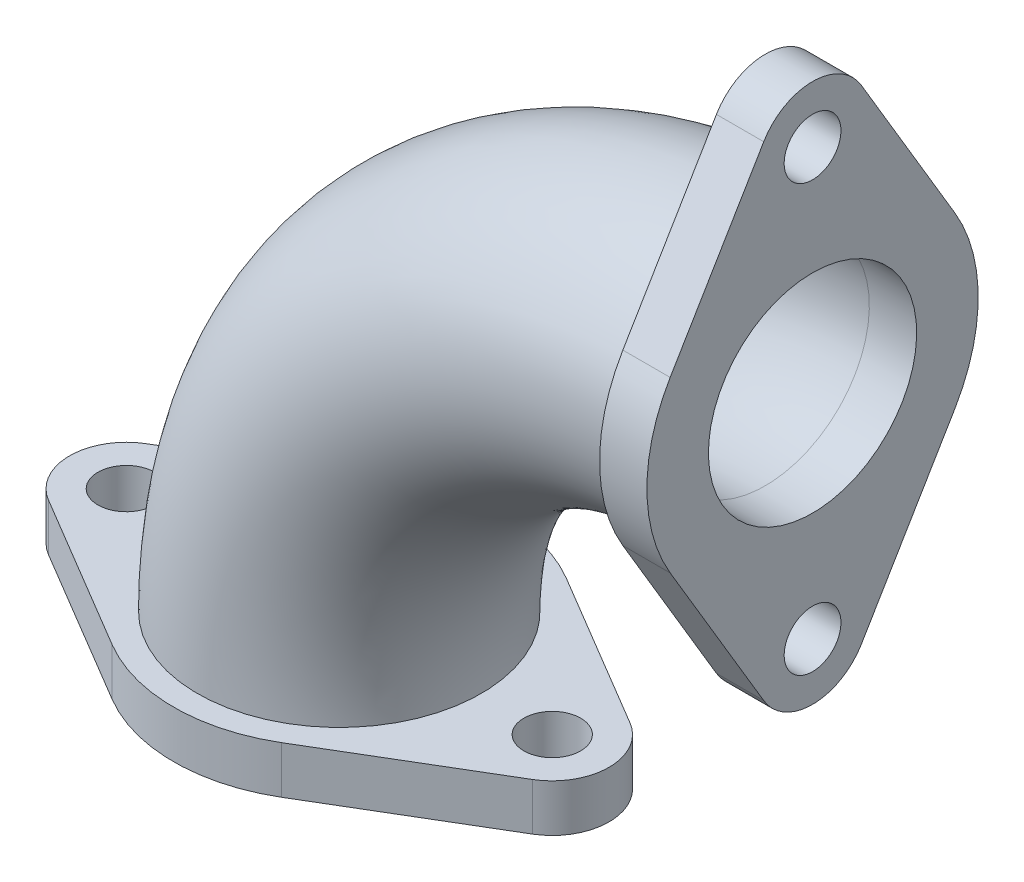
ISO-10303-21;
HEADER;
FILE_DESCRIPTION(('STEP AP214'),'2;1');
FILE_NAME('part.step','',(''),(''),'','','');
FILE_SCHEMA(('AUTOMOTIVE_DESIGN { 1 0 10303 214 1 1 1 1 }'));
ENDSEC;
DATA;
#1=APPLICATION_CONTEXT('core data for automotive mechanical design processes');
#2=APPLICATION_PROTOCOL_DEFINITION('international standard','automotive_design',2000,#1);
#3=PRODUCT_CONTEXT('',#1,'mechanical');
#4=PRODUCT('Part','Part','',(#3));
#5=PRODUCT_RELATED_PRODUCT_CATEGORY('part','',(#4));
#6=PRODUCT_DEFINITION_FORMATION('','',#4);
#7=PRODUCT_DEFINITION_CONTEXT('part definition',#1,'design');
#8=PRODUCT_DEFINITION('design','',#6,#7);
#9=PRODUCT_DEFINITION_SHAPE('','',#8);
#10=(LENGTH_UNIT() NAMED_UNIT(*) SI_UNIT(.MILLI.,.METRE.));
#11=(NAMED_UNIT(*) PLANE_ANGLE_UNIT() SI_UNIT($,.RADIAN.));
#12=(NAMED_UNIT(*) SI_UNIT($,.STERADIAN.) SOLID_ANGLE_UNIT());
#13=UNCERTAINTY_MEASURE_WITH_UNIT(LENGTH_MEASURE(1.E-05),#10,'distance_accuracy_value','');
#14=(GEOMETRIC_REPRESENTATION_CONTEXT(3) GLOBAL_UNCERTAINTY_ASSIGNED_CONTEXT((#13)) GLOBAL_UNIT_ASSIGNED_CONTEXT((#10,
#11,#12)) REPRESENTATION_CONTEXT('',''));
#15=CARTESIAN_POINT('',(0.,0.,0.));
#16=DIRECTION('',(0.,0.,1.));
#17=DIRECTION('',(1.,0.,0.));
#18=AXIS2_PLACEMENT_3D('',#15,#16,#17);
#19=CARTESIAN_POINT('',(0.,0.,0.));
#20=DIRECTION('',(0.,0.,-1.));
#21=DIRECTION('',(-1.,0.,0.));
#22=AXIS2_PLACEMENT_3D('',#19,#20,#21);
#23=TOROIDAL_SURFACE('',#22,45.,15.);
#24=CARTESIAN_POINT('',(-45.,0.,0.));
#25=DIRECTION('',(0.,1.,0.));
#26=DIRECTION('',(-1.,0.,0.));
#27=AXIS2_PLACEMENT_3D('',#24,#25,#26);
#28=CIRCLE('',#27,15.);
#29=CARTESIAN_POINT('',(-60.,0.,0.));
#30=VERTEX_POINT('',#29);
#31=EDGE_CURVE('E175',#30,#30,#28,.T.);
#32=CARTESIAN_POINT('',(0.,45.,0.));
#33=DIRECTION('',(1.,0.,0.));
#34=DIRECTION('',(0.,1.,0.));
#35=AXIS2_PLACEMENT_3D('',#32,#33,#34);
#36=CIRCLE('',#35,15.);
#37=CARTESIAN_POINT('',(0.,60.,0.));
#38=VERTEX_POINT('',#37);
#39=EDGE_CURVE('E12',#38,#38,#36,.T.);
#40=CARTESIAN_POINT('',(0.,0.,0.));
#41=DIRECTION('',(0.,0.,-1.));
#42=DIRECTION('',(-1.,0.,0.));
#43=AXIS2_PLACEMENT_3D('',#40,#41,#42);
#44=CIRCLE('',#43,60.);
#45=EDGE_CURVE('',#30,#38,#44,.T.);
#46=ORIENTED_EDGE('',*,*,#31,.T.);
#47=ORIENTED_EDGE('',*,*,#39,.F.);
#48=ORIENTED_EDGE('',*,*,#45,.T.);
#49=ORIENTED_EDGE('',*,*,#45,.F.);
#50=EDGE_LOOP('',(#46,#48,#47,#49));
#51=FACE_BOUND('',#50,.T.);
#52=ADVANCED_FACE('F42',(#51),#23,.T.);
#53=CARTESIAN_POINT('',(0.,0.,0.));
#54=DIRECTION('',(0.,0.,-1.));
#55=DIRECTION('',(-1.,0.,0.));
#56=AXIS2_PLACEMENT_3D('',#53,#54,#55);
#57=TOROIDAL_SURFACE('',#56,45.,11.);
#58=CARTESIAN_POINT('',(-45.,0.,0.));
#59=DIRECTION('',(0.,1.,0.));
#60=DIRECTION('',(-1.,0.,0.));
#61=AXIS2_PLACEMENT_3D('',#58,#59,#60);
#62=CIRCLE('',#61,11.);
#63=CARTESIAN_POINT('',(-56.,0.,0.));
#64=VERTEX_POINT('',#63);
#65=EDGE_CURVE('E50',#64,#64,#62,.T.);
#66=CARTESIAN_POINT('',(0.,45.,0.));
#67=DIRECTION('',(1.,0.,0.));
#68=DIRECTION('',(0.,1.,0.));
#69=AXIS2_PLACEMENT_3D('',#66,#67,#68);
#70=CIRCLE('',#69,11.);
#71=CARTESIAN_POINT('',(0.,56.,0.));
#72=VERTEX_POINT('',#71);
#73=EDGE_CURVE('E204',#72,#72,#70,.T.);
#74=CARTESIAN_POINT('',(0.,0.,0.));
#75=DIRECTION('',(0.,0.,-1.));
#76=DIRECTION('',(-1.,0.,0.));
#77=AXIS2_PLACEMENT_3D('',#74,#75,#76);
#78=CIRCLE('',#77,56.);
#79=EDGE_CURVE('',#64,#72,#78,.T.);
#80=ORIENTED_EDGE('',*,*,#65,.F.);
#81=ORIENTED_EDGE('',*,*,#73,.T.);
#82=ORIENTED_EDGE('',*,*,#79,.T.);
#83=ORIENTED_EDGE('',*,*,#79,.F.);
#84=EDGE_LOOP('',(#80,#82,#81,#83));
#85=FACE_BOUND('',#84,.T.);
#86=ADVANCED_FACE('F249',(#85),#57,.F.);
#87=CARTESIAN_POINT('',(5.,45.,0.));
#88=DIRECTION('',(1.,0.,0.));
#89=DIRECTION('',(0.,1.,0.));
#90=AXIS2_PLACEMENT_3D('',#87,#88,#89);
#91=PLANE('',#90);
#92=CARTESIAN_POINT('',(5.,67.5,0.));
#93=DIRECTION('',(1.,0.,0.));
#94=DIRECTION('',(0.,1.,0.));
#95=AXIS2_PLACEMENT_3D('',#92,#93,#94);
#96=CIRCLE('',#95,3.);
#97=CARTESIAN_POINT('',(5.,70.5,0.));
#98=VERTEX_POINT('',#97);
#99=EDGE_CURVE('E201',#98,#98,#96,.T.);
#100=ORIENTED_EDGE('',*,*,#99,.F.);
#101=EDGE_LOOP('',(#100));
#102=FACE_BOUND('',#101,.T.);
#103=CARTESIAN_POINT('',(5.,45.,0.));
#104=DIRECTION('',(1.,0.,0.));
#105=DIRECTION('',(0.,1.,0.));
#106=AXIS2_PLACEMENT_3D('',#103,#104,#105);
#107=CIRCLE('',#106,17.5);
#108=CARTESIAN_POINT('',(5.,53.9444444444444,15.0415063600773));
#109=VERTEX_POINT('',#108);
#110=CARTESIAN_POINT('',(5.,36.0555555555556,15.0415063600773));
#111=VERTEX_POINT('',#110);
#112=EDGE_CURVE('E159',#109,#111,#107,.T.);
#113=ORIENTED_EDGE('',*,*,#112,.T.);
#114=DIRECTION('',(0.,-0.859514649147276,-0.511111111111112));
#115=VECTOR('',#114,1.);
#116=CARTESIAN_POINT('',(5.,36.0555555555556,15.0415063600773));
#117=LINE('',#116,#115);
#118=CARTESIAN_POINT('',(5.,19.4333333333333,5.15708789488364));
#119=VERTEX_POINT('',#118);
#120=EDGE_CURVE('E103',#111,#119,#117,.T.);
#121=ORIENTED_EDGE('',*,*,#120,.T.);
#122=CARTESIAN_POINT('',(5.,22.5,0.));
#123=DIRECTION('',(1.,0.,0.));
#124=DIRECTION('',(0.,1.,0.));
#125=AXIS2_PLACEMENT_3D('',#122,#123,#124);
#126=CIRCLE('',#125,5.99999999999999);
#127=CARTESIAN_POINT('',(5.,19.4333333333333,-5.15708789488365));
#128=VERTEX_POINT('',#127);
#129=EDGE_CURVE('E213',#119,#128,#126,.T.);
#130=ORIENTED_EDGE('',*,*,#129,.T.);
#131=DIRECTION('',(0.,0.859514649147276,-0.511111111111112));
#132=VECTOR('',#131,1.);
#133=CARTESIAN_POINT('',(5.,36.0555555555556,-15.0415063600773));
#134=LINE('',#133,#132);
#135=CARTESIAN_POINT('',(5.,36.0555555555556,-15.0415063600773));
#136=VERTEX_POINT('',#135);
#137=EDGE_CURVE('E215',#128,#136,#134,.T.);
#138=ORIENTED_EDGE('',*,*,#137,.T.);
#139=CARTESIAN_POINT('',(5.,45.,0.));
#140=DIRECTION('',(1.,0.,0.));
#141=DIRECTION('',(0.,1.,0.));
#142=AXIS2_PLACEMENT_3D('',#139,#140,#141);
#143=CIRCLE('',#142,17.5);
#144=CARTESIAN_POINT('',(5.,53.9444444444444,-15.0415063600773));
#145=VERTEX_POINT('',#144);
#146=EDGE_CURVE('E126',#136,#145,#143,.T.);
#147=ORIENTED_EDGE('',*,*,#146,.T.);
#148=DIRECTION('',(0.,0.859514649147276,0.511111111111111));
#149=VECTOR('',#148,1.);
#150=CARTESIAN_POINT('',(5.,70.5666666666667,-5.15708789488367));
#151=LINE('',#150,#149);
#152=CARTESIAN_POINT('',(5.,70.5666666666667,-5.15708789488367));
#153=VERTEX_POINT('',#152);
#154=EDGE_CURVE('E119',#145,#153,#151,.T.);
#155=ORIENTED_EDGE('',*,*,#154,.T.);
#156=CARTESIAN_POINT('',(5.,67.5,0.));
#157=DIRECTION('',(1.,0.,0.));
#158=DIRECTION('',(0.,1.,0.));
#159=AXIS2_PLACEMENT_3D('',#156,#157,#158);
#160=CIRCLE('',#159,6.);
#161=CARTESIAN_POINT('',(5.,70.5666666666667,5.15708789488366));
#162=VERTEX_POINT('',#161);
#163=EDGE_CURVE('E124',#153,#162,#160,.T.);
#164=ORIENTED_EDGE('',*,*,#163,.T.);
#165=DIRECTION('',(0.,-0.859514649147276,0.511111111111112));
#166=VECTOR('',#165,1.);
#167=CARTESIAN_POINT('',(5.,70.5666666666667,5.15708789488364));
#168=LINE('',#167,#166);
#169=EDGE_CURVE('E58',#162,#109,#168,.T.);
#170=ORIENTED_EDGE('',*,*,#169,.T.);
#171=EDGE_LOOP('',(#113,#121,#130,#138,#147,#155,#164,#170));
#172=FACE_BOUND('',#171,.T.);
#173=CARTESIAN_POINT('',(5.,45.,0.));
#174=DIRECTION('',(1.,0.,0.));
#175=DIRECTION('',(0.,1.,0.));
#176=AXIS2_PLACEMENT_3D('',#173,#174,#175);
#177=CIRCLE('',#176,11.);
#178=CARTESIAN_POINT('',(5.,56.,0.));
#179=VERTEX_POINT('',#178);
#180=EDGE_CURVE('E148',#179,#179,#177,.T.);
#181=ORIENTED_EDGE('',*,*,#180,.F.);
#182=EDGE_LOOP('',(#181));
#183=FACE_BOUND('',#182,.T.);
#184=CARTESIAN_POINT('',(5.,22.5,0.));
#185=DIRECTION('',(1.,0.,0.));
#186=DIRECTION('',(0.,1.,0.));
#187=AXIS2_PLACEMENT_3D('',#184,#185,#186);
#188=CIRCLE('',#187,3.);
#189=CARTESIAN_POINT('',(5.,25.5,0.));
#190=VERTEX_POINT('',#189);
#191=EDGE_CURVE('E182',#190,#190,#188,.T.);
#192=ORIENTED_EDGE('',*,*,#191,.F.);
#193=EDGE_LOOP('',(#192));
#194=FACE_BOUND('',#193,.T.);
#195=ADVANCED_FACE('F121',(#102,#172,#183,#194),#91,.T.);
#196=CARTESIAN_POINT('',(0.,45.,0.));
#197=DIRECTION('',(1.,0.,0.));
#198=DIRECTION('',(0.,1.,0.));
#199=AXIS2_PLACEMENT_3D('',#196,#197,#198);
#200=PLANE('',#199);
#201=ORIENTED_EDGE('',*,*,#39,.T.);
#202=EDGE_LOOP('',(#201));
#203=FACE_BOUND('',#202,.T.);
#204=CARTESIAN_POINT('',(0.,45.,0.));
#205=DIRECTION('',(1.,0.,0.));
#206=DIRECTION('',(0.,1.,0.));
#207=AXIS2_PLACEMENT_3D('',#204,#205,#206);
#208=CIRCLE('',#207,17.5);
#209=CARTESIAN_POINT('',(0.,53.9444444444444,15.0415063600773));
#210=VERTEX_POINT('',#209);
#211=CARTESIAN_POINT('',(0.,36.0555555555556,15.0415063600773));
#212=VERTEX_POINT('',#211);
#213=EDGE_CURVE('E144',#210,#212,#208,.T.);
#214=ORIENTED_EDGE('',*,*,#213,.F.);
#215=DIRECTION('',(0.,-0.859514649147276,0.511111111111112));
#216=VECTOR('',#215,1.);
#217=CARTESIAN_POINT('',(0.,70.5666666666667,5.15708789488364));
#218=LINE('',#217,#216);
#219=CARTESIAN_POINT('',(0.,70.5666666666667,5.15708789488366));
#220=VERTEX_POINT('',#219);
#221=EDGE_CURVE('E94',#220,#210,#218,.T.);
#222=ORIENTED_EDGE('',*,*,#221,.F.);
#223=CARTESIAN_POINT('',(0.,67.5,0.));
#224=DIRECTION('',(1.,0.,0.));
#225=DIRECTION('',(0.,1.,0.));
#226=AXIS2_PLACEMENT_3D('',#223,#224,#225);
#227=CIRCLE('',#226,6.);
#228=CARTESIAN_POINT('',(0.,70.5666666666667,-5.15708789488367));
#229=VERTEX_POINT('',#228);
#230=EDGE_CURVE('E88',#229,#220,#227,.T.);
#231=ORIENTED_EDGE('',*,*,#230,.F.);
#232=DIRECTION('',(0.,0.859514649147276,0.511111111111111));
#233=VECTOR('',#232,1.);
#234=CARTESIAN_POINT('',(0.,70.5666666666667,-5.15708789488367));
#235=LINE('',#234,#233);
#236=CARTESIAN_POINT('',(0.,53.9444444444444,-15.0415063600773));
#237=VERTEX_POINT('',#236);
#238=EDGE_CURVE('E134',#237,#229,#235,.T.);
#239=ORIENTED_EDGE('',*,*,#238,.F.);
#240=CARTESIAN_POINT('',(0.,45.,0.));
#241=DIRECTION('',(1.,0.,0.));
#242=DIRECTION('',(0.,1.,0.));
#243=AXIS2_PLACEMENT_3D('',#240,#241,#242);
#244=CIRCLE('',#243,17.5);
#245=CARTESIAN_POINT('',(0.,36.0555555555556,-15.0415063600773));
#246=VERTEX_POINT('',#245);
#247=EDGE_CURVE('E154',#246,#237,#244,.T.);
#248=ORIENTED_EDGE('',*,*,#247,.F.);
#249=DIRECTION('',(0.,0.859514649147276,-0.511111111111112));
#250=VECTOR('',#249,1.);
#251=CARTESIAN_POINT('',(0.,36.0555555555556,-15.0415063600773));
#252=LINE('',#251,#250);
#253=CARTESIAN_POINT('',(0.,19.4333333333333,-5.15708789488365));
#254=VERTEX_POINT('',#253);
#255=EDGE_CURVE('E152',#254,#246,#252,.T.);
#256=ORIENTED_EDGE('',*,*,#255,.F.);
#257=CARTESIAN_POINT('',(0.,22.5,0.));
#258=DIRECTION('',(1.,0.,0.));
#259=DIRECTION('',(0.,1.,0.));
#260=AXIS2_PLACEMENT_3D('',#257,#258,#259);
#261=CIRCLE('',#260,5.99999999999999);
#262=CARTESIAN_POINT('',(0.,19.4333333333333,5.15708789488364));
#263=VERTEX_POINT('',#262);
#264=EDGE_CURVE('E150',#263,#254,#261,.T.);
#265=ORIENTED_EDGE('',*,*,#264,.F.);
#266=DIRECTION('',(0.,-0.859514649147276,-0.511111111111112));
#267=VECTOR('',#266,1.);
#268=CARTESIAN_POINT('',(0.,36.0555555555556,15.0415063600773));
#269=LINE('',#268,#267);
#270=EDGE_CURVE('E147',#212,#263,#269,.T.);
#271=ORIENTED_EDGE('',*,*,#270,.F.);
#272=EDGE_LOOP('',(#214,#222,#231,#239,#248,#256,#265,#271));
#273=FACE_BOUND('',#272,.T.);
#274=CARTESIAN_POINT('',(0.,67.5,0.));
#275=DIRECTION('',(1.,0.,0.));
#276=DIRECTION('',(0.,1.,0.));
#277=AXIS2_PLACEMENT_3D('',#274,#275,#276);
#278=CIRCLE('',#277,3.);
#279=CARTESIAN_POINT('',(0.,70.5,0.));
#280=VERTEX_POINT('',#279);
#281=EDGE_CURVE('E199',#280,#280,#278,.T.);
#282=ORIENTED_EDGE('',*,*,#281,.T.);
#283=EDGE_LOOP('',(#282));
#284=FACE_BOUND('',#283,.T.);
#285=CARTESIAN_POINT('',(0.,22.5,0.));
#286=DIRECTION('',(1.,0.,0.));
#287=DIRECTION('',(0.,1.,0.));
#288=AXIS2_PLACEMENT_3D('',#285,#286,#287);
#289=CIRCLE('',#288,3.);
#290=CARTESIAN_POINT('',(0.,25.5,0.));
#291=VERTEX_POINT('',#290);
#292=EDGE_CURVE('E177',#291,#291,#289,.T.);
#293=ORIENTED_EDGE('',*,*,#292,.T.);
#294=EDGE_LOOP('',(#293));
#295=FACE_BOUND('',#294,.T.);
#296=ADVANCED_FACE('F228',(#203,#273,#284,#295),#200,.F.);
#297=CARTESIAN_POINT('',(5.,45.,0.));
#298=DIRECTION('',(-1.,0.,0.));
#299=DIRECTION('',(0.,-1.,0.));
#300=AXIS2_PLACEMENT_3D('',#297,#298,#299);
#301=CYLINDRICAL_SURFACE('',#300,17.5);
#302=ORIENTED_EDGE('',*,*,#213,.T.);
#303=DIRECTION('',(-1.,0.,0.));
#304=VECTOR('',#303,1.);
#305=CARTESIAN_POINT('',(5.,36.0555555555556,15.0415063600773));
#306=LINE('',#305,#304);
#307=EDGE_CURVE('E172',#111,#212,#306,.T.);
#308=ORIENTED_EDGE('',*,*,#307,.F.);
#309=ORIENTED_EDGE('',*,*,#112,.F.);
#310=DIRECTION('',(-1.,0.,0.));
#311=VECTOR('',#310,1.);
#312=CARTESIAN_POINT('',(5.,53.9444444444444,15.0415063600773));
#313=LINE('',#312,#311);
#314=EDGE_CURVE('E140',#109,#210,#313,.T.);
#315=ORIENTED_EDGE('',*,*,#314,.T.);
#316=EDGE_LOOP('',(#302,#308,#309,#315));
#317=FACE_BOUND('',#316,.T.);
#318=ADVANCED_FACE('F233',(#317),#301,.T.);
#319=CARTESIAN_POINT('',(5.,36.0555555555556,15.0415063600773));
#320=DIRECTION('',(0.,0.511111111111112,-0.859514649147276));
#321=DIRECTION('',(0.,0.859514649147276,0.511111111111112));
#322=AXIS2_PLACEMENT_3D('',#319,#320,#321);
#323=PLANE('',#322);
#324=ORIENTED_EDGE('',*,*,#270,.T.);
#325=DIRECTION('',(-1.,0.,0.));
#326=VECTOR('',#325,1.);
#327=CARTESIAN_POINT('',(5.,19.4333333333333,5.15708789488364));
#328=LINE('',#327,#326);
#329=EDGE_CURVE('E169',#119,#263,#328,.T.);
#330=ORIENTED_EDGE('',*,*,#329,.F.);
#331=ORIENTED_EDGE('',*,*,#120,.F.);
#332=ORIENTED_EDGE('',*,*,#307,.T.);
#333=EDGE_LOOP('',(#324,#330,#331,#332));
#334=FACE_BOUND('',#333,.T.);
#335=ADVANCED_FACE('F262',(#334),#323,.F.);
#336=CARTESIAN_POINT('',(5.,22.5,0.));
#337=DIRECTION('',(-1.,0.,0.));
#338=DIRECTION('',(0.,-1.,0.));
#339=AXIS2_PLACEMENT_3D('',#336,#337,#338);
#340=CYLINDRICAL_SURFACE('',#339,5.99999999999999);
#341=ORIENTED_EDGE('',*,*,#264,.T.);
#342=DIRECTION('',(-1.,0.,0.));
#343=VECTOR('',#342,1.);
#344=CARTESIAN_POINT('',(5.,19.4333333333333,-5.15708789488365));
#345=LINE('',#344,#343);
#346=EDGE_CURVE('E166',#128,#254,#345,.T.);
#347=ORIENTED_EDGE('',*,*,#346,.F.);
#348=ORIENTED_EDGE('',*,*,#129,.F.);
#349=ORIENTED_EDGE('',*,*,#329,.T.);
#350=EDGE_LOOP('',(#341,#347,#348,#349));
#351=FACE_BOUND('',#350,.T.);
#352=ADVANCED_FACE('F563',(#351),#340,.T.);
#353=CARTESIAN_POINT('',(5.,36.0555555555556,-15.0415063600773));
#354=DIRECTION('',(0.,0.511111111111112,0.859514649147276));
#355=DIRECTION('',(0.,-0.859514649147276,0.511111111111112));
#356=AXIS2_PLACEMENT_3D('',#353,#354,#355);
#357=PLANE('',#356);
#358=ORIENTED_EDGE('',*,*,#255,.T.);
#359=DIRECTION('',(-1.,0.,0.));
#360=VECTOR('',#359,1.);
#361=CARTESIAN_POINT('',(5.,36.0555555555556,-15.0415063600773));
#362=LINE('',#361,#360);
#363=EDGE_CURVE('E163',#136,#246,#362,.T.);
#364=ORIENTED_EDGE('',*,*,#363,.F.);
#365=ORIENTED_EDGE('',*,*,#137,.F.);
#366=ORIENTED_EDGE('',*,*,#346,.T.);
#367=EDGE_LOOP('',(#358,#364,#365,#366));
#368=FACE_BOUND('',#367,.T.);
#369=ADVANCED_FACE('F221',(#368),#357,.F.);
#370=CARTESIAN_POINT('',(5.,45.,0.));
#371=DIRECTION('',(-1.,0.,0.));
#372=DIRECTION('',(0.,-1.,0.));
#373=AXIS2_PLACEMENT_3D('',#370,#371,#372);
#374=CYLINDRICAL_SURFACE('',#373,17.5);
#375=ORIENTED_EDGE('',*,*,#247,.T.);
#376=DIRECTION('',(-1.,0.,0.));
#377=VECTOR('',#376,1.);
#378=CARTESIAN_POINT('',(5.,53.9444444444444,-15.0415063600773));
#379=LINE('',#378,#377);
#380=EDGE_CURVE('E135',#145,#237,#379,.T.);
#381=ORIENTED_EDGE('',*,*,#380,.F.);
#382=ORIENTED_EDGE('',*,*,#146,.F.);
#383=ORIENTED_EDGE('',*,*,#363,.T.);
#384=EDGE_LOOP('',(#375,#381,#382,#383));
#385=FACE_BOUND('',#384,.T.);
#386=ADVANCED_FACE('F225',(#385),#374,.T.);
#387=CARTESIAN_POINT('',(5.,70.5666666666667,-5.15708789488367));
#388=DIRECTION('',(0.,-0.511111111111111,0.859514649147276));
#389=DIRECTION('',(0.,-0.859514649147276,-0.511111111111111));
#390=AXIS2_PLACEMENT_3D('',#387,#388,#389);
#391=PLANE('',#390);
#392=ORIENTED_EDGE('',*,*,#238,.T.);
#393=DIRECTION('',(-1.,0.,0.));
#394=VECTOR('',#393,1.);
#395=CARTESIAN_POINT('',(5.,70.5666666666667,-5.15708789488367));
#396=LINE('',#395,#394);
#397=EDGE_CURVE('E131',#153,#229,#396,.T.);
#398=ORIENTED_EDGE('',*,*,#397,.F.);
#399=ORIENTED_EDGE('',*,*,#154,.F.);
#400=ORIENTED_EDGE('',*,*,#380,.T.);
#401=EDGE_LOOP('',(#392,#398,#399,#400));
#402=FACE_BOUND('',#401,.T.);
#403=ADVANCED_FACE('F132',(#402),#391,.F.);
#404=CARTESIAN_POINT('',(5.,67.5,0.));
#405=DIRECTION('',(-1.,0.,0.));
#406=DIRECTION('',(0.,-1.,0.));
#407=AXIS2_PLACEMENT_3D('',#404,#405,#406);
#408=CYLINDRICAL_SURFACE('',#407,6.);
#409=ORIENTED_EDGE('',*,*,#230,.T.);
#410=DIRECTION('',(-1.,0.,0.));
#411=VECTOR('',#410,1.);
#412=CARTESIAN_POINT('',(5.,70.5666666666667,5.15708789488366));
#413=LINE('',#412,#411);
#414=EDGE_CURVE('E136',#162,#220,#413,.T.);
#415=ORIENTED_EDGE('',*,*,#414,.F.);
#416=ORIENTED_EDGE('',*,*,#163,.F.);
#417=ORIENTED_EDGE('',*,*,#397,.T.);
#418=EDGE_LOOP('',(#409,#415,#416,#417));
#419=FACE_BOUND('',#418,.T.);
#420=ADVANCED_FACE('F138',(#419),#408,.T.);
#421=CARTESIAN_POINT('',(5.,70.5666666666667,5.15708789488364));
#422=DIRECTION('',(0.,-0.511111111111112,-0.859514649147276));
#423=DIRECTION('',(0.,0.859514649147276,-0.511111111111112));
#424=AXIS2_PLACEMENT_3D('',#421,#422,#423);
#425=PLANE('',#424);
#426=ORIENTED_EDGE('',*,*,#221,.T.);
#427=ORIENTED_EDGE('',*,*,#314,.F.);
#428=ORIENTED_EDGE('',*,*,#169,.F.);
#429=ORIENTED_EDGE('',*,*,#414,.T.);
#430=EDGE_LOOP('',(#426,#427,#428,#429));
#431=FACE_BOUND('',#430,.T.);
#432=ADVANCED_FACE('F235',(#431),#425,.F.);
#433=CARTESIAN_POINT('',(5.,45.,0.));
#434=DIRECTION('',(-1.,0.,0.));
#435=DIRECTION('',(0.,-1.,0.));
#436=AXIS2_PLACEMENT_3D('',#433,#434,#435);
#437=CYLINDRICAL_SURFACE('',#436,11.);
#438=ORIENTED_EDGE('',*,*,#180,.T.);
#439=EDGE_LOOP('',(#438));
#440=FACE_BOUND('',#439,.T.);
#441=ORIENTED_EDGE('',*,*,#73,.F.);
#442=EDGE_LOOP('',(#441));
#443=FACE_BOUND('',#442,.T.);
#444=ADVANCED_FACE('F237',(#440,#443),#437,.F.);
#445=CARTESIAN_POINT('',(5.,67.5,0.));
#446=DIRECTION('',(-1.,0.,0.));
#447=DIRECTION('',(0.,-1.,0.));
#448=AXIS2_PLACEMENT_3D('',#445,#446,#447);
#449=CYLINDRICAL_SURFACE('',#448,3.);
#450=ORIENTED_EDGE('',*,*,#99,.T.);
#451=EDGE_LOOP('',(#450));
#452=FACE_BOUND('',#451,.T.);
#453=ORIENTED_EDGE('',*,*,#281,.F.);
#454=EDGE_LOOP('',(#453));
#455=FACE_BOUND('',#454,.T.);
#456=ADVANCED_FACE('F243',(#452,#455),#449,.F.);
#457=CARTESIAN_POINT('',(5.,22.5,0.));
#458=DIRECTION('',(-1.,0.,0.));
#459=DIRECTION('',(0.,-1.,0.));
#460=AXIS2_PLACEMENT_3D('',#457,#458,#459);
#461=CYLINDRICAL_SURFACE('',#460,3.);
#462=ORIENTED_EDGE('',*,*,#191,.T.);
#463=EDGE_LOOP('',(#462));
#464=FACE_BOUND('',#463,.T.);
#465=ORIENTED_EDGE('',*,*,#292,.F.);
#466=EDGE_LOOP('',(#465));
#467=FACE_BOUND('',#466,.T.);
#468=ADVANCED_FACE('F269',(#464,#467),#461,.F.);
#469=CARTESIAN_POINT('',(-67.5,-5.,0.));
#470=DIRECTION('',(0.,-1.,0.));
#471=DIRECTION('',(1.,0.,0.));
#472=AXIS2_PLACEMENT_3D('',#469,#470,#471);
#473=PLANE('',#472);
#474=CARTESIAN_POINT('',(-22.5,-5.,0.));
#475=DIRECTION('',(0.,-1.,0.));
#476=DIRECTION('',(1.,0.,0.));
#477=AXIS2_PLACEMENT_3D('',#474,#475,#476);
#478=CIRCLE('',#477,3.);
#479=CARTESIAN_POINT('',(-19.5,-5.,0.));
#480=VERTEX_POINT('',#479);
#481=EDGE_CURVE('E338',#480,#480,#478,.T.);
#482=ORIENTED_EDGE('',*,*,#481,.F.);
#483=EDGE_LOOP('',(#482));
#484=FACE_BOUND('',#483,.T.);
#485=CARTESIAN_POINT('',(-67.5,-5.,0.));
#486=DIRECTION('',(0.,-1.,0.));
#487=DIRECTION('',(1.,0.,0.));
#488=AXIS2_PLACEMENT_3D('',#485,#486,#487);
#489=CIRCLE('',#488,6.);
#490=CARTESIAN_POINT('',(-70.5666666666667,-5.,5.15708789488366));
#491=VERTEX_POINT('',#490);
#492=CARTESIAN_POINT('',(-70.5666666666667,-5.,-5.15708789488366));
#493=VERTEX_POINT('',#492);
#494=EDGE_CURVE('E347',#491,#493,#489,.T.);
#495=ORIENTED_EDGE('',*,*,#494,.T.);
#496=DIRECTION('',(0.859514649147276,0.,-0.511111111111111));
#497=VECTOR('',#496,1.);
#498=CARTESIAN_POINT('',(-70.5666666666667,-5.,-5.15708789488366));
#499=LINE('',#498,#497);
#500=CARTESIAN_POINT('',(-53.9444444444444,-5.,-15.0415063600773));
#501=VERTEX_POINT('',#500);
#502=EDGE_CURVE('E350',#493,#501,#499,.T.);
#503=ORIENTED_EDGE('',*,*,#502,.T.);
#504=CARTESIAN_POINT('',(-45.,-5.,0.));
#505=DIRECTION('',(0.,-1.,0.));
#506=DIRECTION('',(1.,0.,0.));
#507=AXIS2_PLACEMENT_3D('',#504,#505,#506);
#508=CIRCLE('',#507,17.5);
#509=CARTESIAN_POINT('',(-36.0555555555556,-5.,-15.0415063600773));
#510=VERTEX_POINT('',#509);
#511=EDGE_CURVE('E354',#501,#510,#508,.T.);
#512=ORIENTED_EDGE('',*,*,#511,.T.);
#513=DIRECTION('',(0.859514649147276,0.,0.511111111111111));
#514=VECTOR('',#513,1.);
#515=CARTESIAN_POINT('',(-36.0555555555556,-5.,-15.0415063600773));
#516=LINE('',#515,#514);
#517=CARTESIAN_POINT('',(-19.4333333333333,-5.,-5.15708789488365));
#518=VERTEX_POINT('',#517);
#519=EDGE_CURVE('E357',#510,#518,#516,.T.);
#520=ORIENTED_EDGE('',*,*,#519,.T.);
#521=CARTESIAN_POINT('',(-22.5,-5.,0.));
#522=DIRECTION('',(0.,-1.,0.));
#523=DIRECTION('',(1.,0.,0.));
#524=AXIS2_PLACEMENT_3D('',#521,#522,#523);
#525=CIRCLE('',#524,6.);
#526=CARTESIAN_POINT('',(-19.4333333333333,-5.,5.15708789488365));
#527=VERTEX_POINT('',#526);
#528=EDGE_CURVE('E360',#518,#527,#525,.T.);
#529=ORIENTED_EDGE('',*,*,#528,.T.);
#530=DIRECTION('',(-0.859514649147276,0.,0.511111111111111));
#531=VECTOR('',#530,1.);
#532=CARTESIAN_POINT('',(-36.0555555555556,-5.,15.0415063600773));
#533=LINE('',#532,#531);
#534=CARTESIAN_POINT('',(-36.0555555555556,-5.,15.0415063600773));
#535=VERTEX_POINT('',#534);
#536=EDGE_CURVE('E363',#527,#535,#533,.T.);
#537=ORIENTED_EDGE('',*,*,#536,.T.);
#538=CARTESIAN_POINT('',(-45.,-5.,0.));
#539=DIRECTION('',(0.,-1.,0.));
#540=DIRECTION('',(1.,0.,0.));
#541=AXIS2_PLACEMENT_3D('',#538,#539,#540);
#542=CIRCLE('',#541,17.5);
#543=CARTESIAN_POINT('',(-53.9444444444444,-5.,15.0415063600773));
#544=VERTEX_POINT('',#543);
#545=EDGE_CURVE('E366',#535,#544,#542,.T.);
#546=ORIENTED_EDGE('',*,*,#545,.T.);
#547=DIRECTION('',(-0.859514649147276,0.,-0.511111111111111));
#548=VECTOR('',#547,1.);
#549=CARTESIAN_POINT('',(-53.9444444444444,-5.,15.0415063600773));
#550=LINE('',#549,#548);
#551=EDGE_CURVE('E369',#544,#491,#550,.T.);
#552=ORIENTED_EDGE('',*,*,#551,.T.);
#553=EDGE_LOOP('',(#495,#503,#512,#520,#529,#537,#546,#552));
#554=FACE_BOUND('',#553,.T.);
#555=CARTESIAN_POINT('',(-45.,-5.,0.));
#556=DIRECTION('',(0.,-1.,0.));
#557=DIRECTION('',(1.,0.,0.));
#558=AXIS2_PLACEMENT_3D('',#555,#556,#557);
#559=CIRCLE('',#558,11.);
#560=CARTESIAN_POINT('',(-34.,-5.,0.));
#561=VERTEX_POINT('',#560);
#562=EDGE_CURVE('E341',#561,#561,#559,.T.);
#563=ORIENTED_EDGE('',*,*,#562,.F.);
#564=EDGE_LOOP('',(#563));
#565=FACE_BOUND('',#564,.T.);
#566=CARTESIAN_POINT('',(-67.5,-5.,0.));
#567=DIRECTION('',(0.,-1.,0.));
#568=DIRECTION('',(1.,0.,0.));
#569=AXIS2_PLACEMENT_3D('',#566,#567,#568);
#570=CIRCLE('',#569,3.00000000000001);
#571=CARTESIAN_POINT('',(-64.5,-5.,0.));
#572=VERTEX_POINT('',#571);
#573=EDGE_CURVE('E329',#572,#572,#570,.T.);
#574=ORIENTED_EDGE('',*,*,#573,.F.);
#575=EDGE_LOOP('',(#574));
#576=FACE_BOUND('',#575,.T.);
#577=ADVANCED_FACE('F273',(#484,#554,#565,#576),#473,.T.);
#578=CARTESIAN_POINT('',(-67.5,0.,0.));
#579=DIRECTION('',(0.,-1.,0.));
#580=DIRECTION('',(1.,0.,0.));
#581=AXIS2_PLACEMENT_3D('',#578,#579,#580);
#582=PLANE('',#581);
#583=ORIENTED_EDGE('',*,*,#31,.F.);
#584=EDGE_LOOP('',(#583));
#585=FACE_BOUND('',#584,.T.);
#586=CARTESIAN_POINT('',(-67.5,0.,0.));
#587=DIRECTION('',(0.,-1.,0.));
#588=DIRECTION('',(1.,0.,0.));
#589=AXIS2_PLACEMENT_3D('',#586,#587,#588);
#590=CIRCLE('',#589,6.);
#591=CARTESIAN_POINT('',(-70.5666666666667,0.,5.15708789488366));
#592=VERTEX_POINT('',#591);
#593=CARTESIAN_POINT('',(-70.5666666666667,0.,-5.15708789488366));
#594=VERTEX_POINT('',#593);
#595=EDGE_CURVE('E346',#592,#594,#590,.T.);
#596=ORIENTED_EDGE('',*,*,#595,.F.);
#597=DIRECTION('',(-0.859514649147276,0.,-0.511111111111111));
#598=VECTOR('',#597,1.);
#599=CARTESIAN_POINT('',(-53.9444444444444,0.,15.0415063600773));
#600=LINE('',#599,#598);
#601=CARTESIAN_POINT('',(-53.9444444444444,0.,15.0415063600773));
#602=VERTEX_POINT('',#601);
#603=EDGE_CURVE('E351',#602,#592,#600,.T.);
#604=ORIENTED_EDGE('',*,*,#603,.F.);
#605=CARTESIAN_POINT('',(-45.,0.,0.));
#606=DIRECTION('',(0.,-1.,0.));
#607=DIRECTION('',(1.,0.,0.));
#608=AXIS2_PLACEMENT_3D('',#605,#606,#607);
#609=CIRCLE('',#608,17.5);
#610=CARTESIAN_POINT('',(-36.0555555555556,0.,15.0415063600773));
#611=VERTEX_POINT('',#610);
#612=EDGE_CURVE('E388',#611,#602,#609,.T.);
#613=ORIENTED_EDGE('',*,*,#612,.F.);
#614=DIRECTION('',(-0.859514649147276,0.,0.511111111111111));
#615=VECTOR('',#614,1.);
#616=CARTESIAN_POINT('',(-36.0555555555556,0.,15.0415063600773));
#617=LINE('',#616,#615);
#618=CARTESIAN_POINT('',(-19.4333333333333,0.,5.15708789488365));
#619=VERTEX_POINT('',#618);
#620=EDGE_CURVE('E385',#619,#611,#617,.T.);
#621=ORIENTED_EDGE('',*,*,#620,.F.);
#622=CARTESIAN_POINT('',(-22.5,0.,0.));
#623=DIRECTION('',(0.,-1.,0.));
#624=DIRECTION('',(1.,0.,0.));
#625=AXIS2_PLACEMENT_3D('',#622,#623,#624);
#626=CIRCLE('',#625,6.);
#627=CARTESIAN_POINT('',(-19.4333333333333,0.,-5.15708789488365));
#628=VERTEX_POINT('',#627);
#629=EDGE_CURVE('E382',#628,#619,#626,.T.);
#630=ORIENTED_EDGE('',*,*,#629,.F.);
#631=DIRECTION('',(0.859514649147276,0.,0.511111111111111));
#632=VECTOR('',#631,1.);
#633=CARTESIAN_POINT('',(-36.0555555555556,0.,-15.0415063600773));
#634=LINE('',#633,#632);
#635=CARTESIAN_POINT('',(-36.0555555555556,0.,-15.0415063600773));
#636=VERTEX_POINT('',#635);
#637=EDGE_CURVE('E379',#636,#628,#634,.T.);
#638=ORIENTED_EDGE('',*,*,#637,.F.);
#639=CARTESIAN_POINT('',(-45.,0.,0.));
#640=DIRECTION('',(0.,-1.,0.));
#641=DIRECTION('',(1.,0.,0.));
#642=AXIS2_PLACEMENT_3D('',#639,#640,#641);
#643=CIRCLE('',#642,17.5);
#644=CARTESIAN_POINT('',(-53.9444444444444,0.,-15.0415063600773));
#645=VERTEX_POINT('',#644);
#646=EDGE_CURVE('E376',#645,#636,#643,.T.);
#647=ORIENTED_EDGE('',*,*,#646,.F.);
#648=DIRECTION('',(0.859514649147276,0.,-0.511111111111111));
#649=VECTOR('',#648,1.);
#650=CARTESIAN_POINT('',(-70.5666666666667,0.,-5.15708789488366));
#651=LINE('',#650,#649);
#652=EDGE_CURVE('E374',#594,#645,#651,.T.);
#653=ORIENTED_EDGE('',*,*,#652,.F.);
#654=EDGE_LOOP('',(#596,#604,#613,#621,#630,#638,#647,#653));
#655=FACE_BOUND('',#654,.T.);
#656=CARTESIAN_POINT('',(-22.5,0.,0.));
#657=DIRECTION('',(0.,-1.,0.));
#658=DIRECTION('',(1.,0.,0.));
#659=AXIS2_PLACEMENT_3D('',#656,#657,#658);
#660=CIRCLE('',#659,3.);
#661=CARTESIAN_POINT('',(-19.5,0.,0.));
#662=VERTEX_POINT('',#661);
#663=EDGE_CURVE('E335',#662,#662,#660,.T.);
#664=ORIENTED_EDGE('',*,*,#663,.T.);
#665=EDGE_LOOP('',(#664));
#666=FACE_BOUND('',#665,.T.);
#667=CARTESIAN_POINT('',(-67.5,0.,0.));
#668=DIRECTION('',(0.,-1.,0.));
#669=DIRECTION('',(1.,0.,0.));
#670=AXIS2_PLACEMENT_3D('',#667,#668,#669);
#671=CIRCLE('',#670,3.00000000000001);
#672=CARTESIAN_POINT('',(-64.5,0.,0.));
#673=VERTEX_POINT('',#672);
#674=EDGE_CURVE('E332',#673,#673,#671,.T.);
#675=ORIENTED_EDGE('',*,*,#674,.T.);
#676=EDGE_LOOP('',(#675));
#677=FACE_BOUND('',#676,.T.);
#678=ADVANCED_FACE('F279',(#585,#655,#666,#677),#582,.F.);
#679=CARTESIAN_POINT('',(-67.5,-5.,0.));
#680=DIRECTION('',(0.,1.,0.));
#681=DIRECTION('',(-1.,0.,0.));
#682=AXIS2_PLACEMENT_3D('',#679,#680,#681);
#683=CYLINDRICAL_SURFACE('',#682,6.);
#684=ORIENTED_EDGE('',*,*,#595,.T.);
#685=DIRECTION('',(0.,1.,0.));
#686=VECTOR('',#685,1.);
#687=CARTESIAN_POINT('',(-70.5666666666667,-5.,-5.15708789488366));
#688=LINE('',#687,#686);
#689=EDGE_CURVE('E178',#493,#594,#688,.T.);
#690=ORIENTED_EDGE('',*,*,#689,.F.);
#691=ORIENTED_EDGE('',*,*,#494,.F.);
#692=DIRECTION('',(0.,1.,0.));
#693=VECTOR('',#692,1.);
#694=CARTESIAN_POINT('',(-70.5666666666667,-5.,5.15708789488366));
#695=LINE('',#694,#693);
#696=EDGE_CURVE('E372',#491,#592,#695,.T.);
#697=ORIENTED_EDGE('',*,*,#696,.T.);
#698=EDGE_LOOP('',(#684,#690,#691,#697));
#699=FACE_BOUND('',#698,.T.);
#700=ADVANCED_FACE('F275',(#699),#683,.T.);
#701=CARTESIAN_POINT('',(-70.5666666666667,-5.,-5.15708789488366));
#702=DIRECTION('',(0.511111111111111,0.,0.859514649147276));
#703=DIRECTION('',(0.859514649147276,0.,-0.511111111111111));
#704=AXIS2_PLACEMENT_3D('',#701,#702,#703);
#705=PLANE('',#704);
#706=ORIENTED_EDGE('',*,*,#652,.T.);
#707=DIRECTION('',(0.,1.,0.));
#708=VECTOR('',#707,1.);
#709=CARTESIAN_POINT('',(-53.9444444444444,-5.,-15.0415063600773));
#710=LINE('',#709,#708);
#711=EDGE_CURVE('E185',#501,#645,#710,.T.);
#712=ORIENTED_EDGE('',*,*,#711,.F.);
#713=ORIENTED_EDGE('',*,*,#502,.F.);
#714=ORIENTED_EDGE('',*,*,#689,.T.);
#715=EDGE_LOOP('',(#706,#712,#713,#714));
#716=FACE_BOUND('',#715,.T.);
#717=ADVANCED_FACE('F278',(#716),#705,.F.);
#718=CARTESIAN_POINT('',(-45.,-5.,0.));
#719=DIRECTION('',(0.,1.,0.));
#720=DIRECTION('',(-1.,0.,0.));
#721=AXIS2_PLACEMENT_3D('',#718,#719,#720);
#722=CYLINDRICAL_SURFACE('',#721,17.5);
#723=ORIENTED_EDGE('',*,*,#646,.T.);
#724=DIRECTION('',(0.,1.,0.));
#725=VECTOR('',#724,1.);
#726=CARTESIAN_POINT('',(-36.0555555555556,-5.,-15.0415063600773));
#727=LINE('',#726,#725);
#728=EDGE_CURVE('E194',#510,#636,#727,.T.);
#729=ORIENTED_EDGE('',*,*,#728,.F.);
#730=ORIENTED_EDGE('',*,*,#511,.F.);
#731=ORIENTED_EDGE('',*,*,#711,.T.);
#732=EDGE_LOOP('',(#723,#729,#730,#731));
#733=FACE_BOUND('',#732,.T.);
#734=ADVANCED_FACE('F283',(#733),#722,.T.);
#735=CARTESIAN_POINT('',(-36.0555555555556,-5.,-15.0415063600773));
#736=DIRECTION('',(-0.511111111111111,0.,0.859514649147276));
#737=DIRECTION('',(0.859514649147276,0.,0.511111111111111));
#738=AXIS2_PLACEMENT_3D('',#735,#736,#737);
#739=PLANE('',#738);
#740=ORIENTED_EDGE('',*,*,#637,.T.);
#741=DIRECTION('',(0.,1.,0.));
#742=VECTOR('',#741,1.);
#743=CARTESIAN_POINT('',(-19.4333333333333,-5.,-5.15708789488365));
#744=LINE('',#743,#742);
#745=EDGE_CURVE('E404',#518,#628,#744,.T.);
#746=ORIENTED_EDGE('',*,*,#745,.F.);
#747=ORIENTED_EDGE('',*,*,#519,.F.);
#748=ORIENTED_EDGE('',*,*,#728,.T.);
#749=EDGE_LOOP('',(#740,#746,#747,#748));
#750=FACE_BOUND('',#749,.T.);
#751=ADVANCED_FACE('F286',(#750),#739,.F.);
#752=CARTESIAN_POINT('',(-22.5,-5.,0.));
#753=DIRECTION('',(0.,1.,0.));
#754=DIRECTION('',(-1.,0.,0.));
#755=AXIS2_PLACEMENT_3D('',#752,#753,#754);
#756=CYLINDRICAL_SURFACE('',#755,6.);
#757=ORIENTED_EDGE('',*,*,#629,.T.);
#758=DIRECTION('',(0.,1.,0.));
#759=VECTOR('',#758,1.);
#760=CARTESIAN_POINT('',(-19.4333333333333,-5.,5.15708789488365));
#761=LINE('',#760,#759);
#762=EDGE_CURVE('E401',#527,#619,#761,.T.);
#763=ORIENTED_EDGE('',*,*,#762,.F.);
#764=ORIENTED_EDGE('',*,*,#528,.F.);
#765=ORIENTED_EDGE('',*,*,#745,.T.);
#766=EDGE_LOOP('',(#757,#763,#764,#765));
#767=FACE_BOUND('',#766,.T.);
#768=ADVANCED_FACE('F290',(#767),#756,.T.);
#769=CARTESIAN_POINT('',(-36.0555555555556,-5.,15.0415063600773));
#770=DIRECTION('',(-0.511111111111111,0.,-0.859514649147276));
#771=DIRECTION('',(-0.859514649147276,0.,0.511111111111111));
#772=AXIS2_PLACEMENT_3D('',#769,#770,#771);
#773=PLANE('',#772);
#774=ORIENTED_EDGE('',*,*,#620,.T.);
#775=DIRECTION('',(0.,1.,0.));
#776=VECTOR('',#775,1.);
#777=CARTESIAN_POINT('',(-36.0555555555556,-5.,15.0415063600773));
#778=LINE('',#777,#776);
#779=EDGE_CURVE('E398',#535,#611,#778,.T.);
#780=ORIENTED_EDGE('',*,*,#779,.F.);
#781=ORIENTED_EDGE('',*,*,#536,.F.);
#782=ORIENTED_EDGE('',*,*,#762,.T.);
#783=EDGE_LOOP('',(#774,#780,#781,#782));
#784=FACE_BOUND('',#783,.T.);
#785=ADVANCED_FACE('F294',(#784),#773,.F.);
#786=CARTESIAN_POINT('',(-45.,-5.,0.));
#787=DIRECTION('',(0.,1.,0.));
#788=DIRECTION('',(-1.,0.,0.));
#789=AXIS2_PLACEMENT_3D('',#786,#787,#788);
#790=CYLINDRICAL_SURFACE('',#789,17.5);
#791=ORIENTED_EDGE('',*,*,#612,.T.);
#792=DIRECTION('',(0.,1.,0.));
#793=VECTOR('',#792,1.);
#794=CARTESIAN_POINT('',(-53.9444444444444,-5.,15.0415063600773));
#795=LINE('',#794,#793);
#796=EDGE_CURVE('E395',#544,#602,#795,.T.);
#797=ORIENTED_EDGE('',*,*,#796,.F.);
#798=ORIENTED_EDGE('',*,*,#545,.F.);
#799=ORIENTED_EDGE('',*,*,#779,.T.);
#800=EDGE_LOOP('',(#791,#797,#798,#799));
#801=FACE_BOUND('',#800,.T.);
#802=ADVANCED_FACE('F298',(#801),#790,.T.);
#803=CARTESIAN_POINT('',(-53.9444444444444,-5.,15.0415063600773));
#804=DIRECTION('',(0.511111111111111,0.,-0.859514649147276));
#805=DIRECTION('',(-0.859514649147276,0.,-0.511111111111111));
#806=AXIS2_PLACEMENT_3D('',#803,#804,#805);
#807=PLANE('',#806);
#808=ORIENTED_EDGE('',*,*,#603,.T.);
#809=ORIENTED_EDGE('',*,*,#696,.F.);
#810=ORIENTED_EDGE('',*,*,#551,.F.);
#811=ORIENTED_EDGE('',*,*,#796,.T.);
#812=EDGE_LOOP('',(#808,#809,#810,#811));
#813=FACE_BOUND('',#812,.T.);
#814=ADVANCED_FACE('F302',(#813),#807,.F.);
#815=CARTESIAN_POINT('',(-45.,-5.,0.));
#816=DIRECTION('',(0.,1.,0.));
#817=DIRECTION('',(-1.,0.,0.));
#818=AXIS2_PLACEMENT_3D('',#815,#816,#817);
#819=CYLINDRICAL_SURFACE('',#818,11.);
#820=ORIENTED_EDGE('',*,*,#562,.T.);
#821=EDGE_LOOP('',(#820));
#822=FACE_BOUND('',#821,.T.);
#823=ORIENTED_EDGE('',*,*,#65,.T.);
#824=EDGE_LOOP('',(#823));
#825=FACE_BOUND('',#824,.T.);
#826=ADVANCED_FACE('F306',(#822,#825),#819,.F.);
#827=CARTESIAN_POINT('',(-22.5,-5.,0.));
#828=DIRECTION('',(0.,1.,0.));
#829=DIRECTION('',(-1.,0.,0.));
#830=AXIS2_PLACEMENT_3D('',#827,#828,#829);
#831=CYLINDRICAL_SURFACE('',#830,3.);
#832=ORIENTED_EDGE('',*,*,#481,.T.);
#833=EDGE_LOOP('',(#832));
#834=FACE_BOUND('',#833,.T.);
#835=ORIENTED_EDGE('',*,*,#663,.F.);
#836=EDGE_LOOP('',(#835));
#837=FACE_BOUND('',#836,.T.);
#838=ADVANCED_FACE('F316',(#834,#837),#831,.F.);
#839=CARTESIAN_POINT('',(-67.5,-5.,0.));
#840=DIRECTION('',(0.,1.,0.));
#841=DIRECTION('',(-1.,0.,0.));
#842=AXIS2_PLACEMENT_3D('',#839,#840,#841);
#843=CYLINDRICAL_SURFACE('',#842,3.00000000000001);
#844=ORIENTED_EDGE('',*,*,#573,.T.);
#845=EDGE_LOOP('',(#844));
#846=FACE_BOUND('',#845,.T.);
#847=ORIENTED_EDGE('',*,*,#674,.F.);
#848=EDGE_LOOP('',(#847));
#849=FACE_BOUND('',#848,.T.);
#850=ADVANCED_FACE('F320',(#846,#849),#843,.F.);
#851=CLOSED_SHELL('',(#52,#86,#195,#296,#318,#335,#352,#369,#386,#403,#420,#432,#444,#456,#468,
#577,#678,#700,#717,#734,#751,#768,#785,#802,#814,#826,#838,#850));
#852=MANIFOLD_SOLID_BREP('B2',#851);
#853=ADVANCED_BREP_SHAPE_REPRESENTATION('',(#18,#852),#14);
#854=SHAPE_DEFINITION_REPRESENTATION(#9,#853);
ENDSEC;
END-ISO-10303-21;
